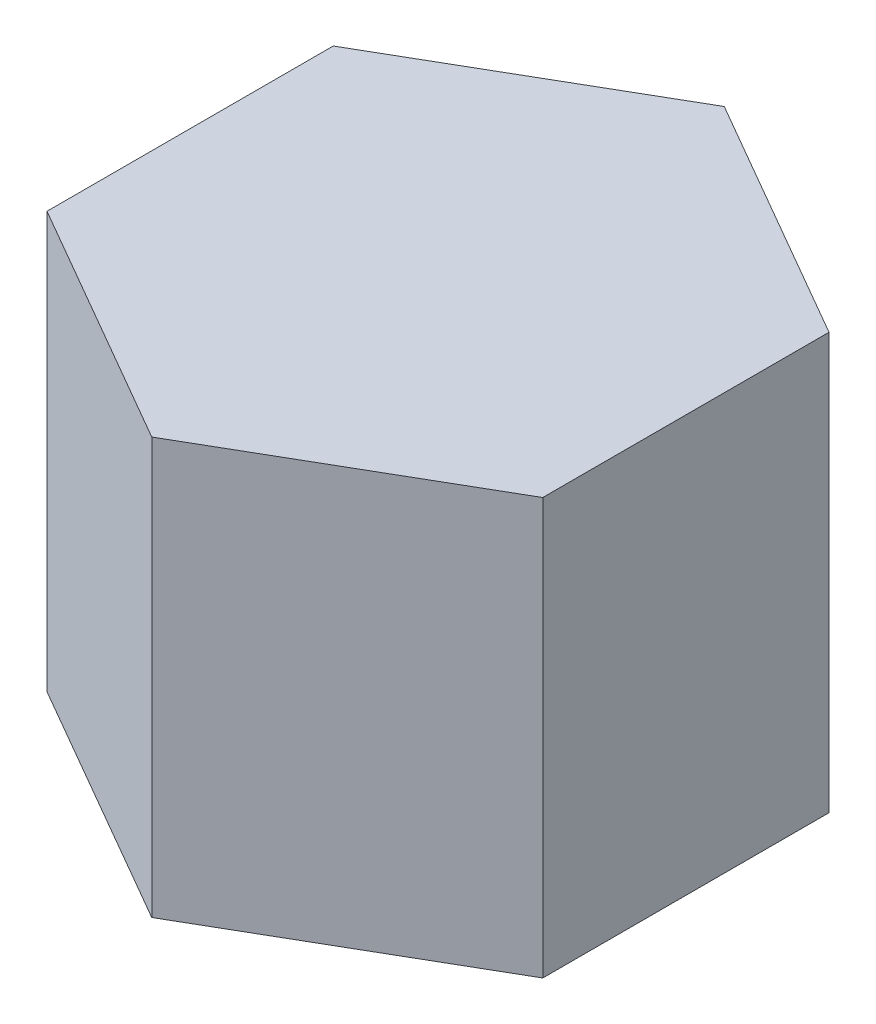
ISO-10303-21;
HEADER;
FILE_DESCRIPTION(('STEP AP214'),'2;1');
FILE_NAME('part.step','',(''),(''),'','','');
FILE_SCHEMA(('AUTOMOTIVE_DESIGN { 1 0 10303 214 1 1 1 1 }'));
ENDSEC;
DATA;
#1=APPLICATION_CONTEXT('core data for automotive mechanical design processes');
#2=APPLICATION_PROTOCOL_DEFINITION('international standard','automotive_design',2000,#1);
#3=PRODUCT_CONTEXT('',#1,'mechanical');
#4=PRODUCT('Part','Part','',(#3));
#5=PRODUCT_RELATED_PRODUCT_CATEGORY('part','',(#4));
#6=PRODUCT_DEFINITION_FORMATION('','',#4);
#7=PRODUCT_DEFINITION_CONTEXT('part definition',#1,'design');
#8=PRODUCT_DEFINITION('design','',#6,#7);
#9=PRODUCT_DEFINITION_SHAPE('','',#8);
#10=(LENGTH_UNIT() NAMED_UNIT(*) SI_UNIT(.MILLI.,.METRE.));
#11=(NAMED_UNIT(*) PLANE_ANGLE_UNIT() SI_UNIT($,.RADIAN.));
#12=(NAMED_UNIT(*) SI_UNIT($,.STERADIAN.) SOLID_ANGLE_UNIT());
#13=UNCERTAINTY_MEASURE_WITH_UNIT(LENGTH_MEASURE(1.E-05),#10,'distance_accuracy_value','');
#14=(GEOMETRIC_REPRESENTATION_CONTEXT(3) GLOBAL_UNCERTAINTY_ASSIGNED_CONTEXT((#13)) GLOBAL_UNIT_ASSIGNED_CONTEXT((#10,
#11,#12)) REPRESENTATION_CONTEXT('',''));
#15=CARTESIAN_POINT('',(0.,0.,0.));
#16=DIRECTION('',(0.,0.,1.));
#17=DIRECTION('',(1.,0.,0.));
#18=AXIS2_PLACEMENT_3D('',#15,#16,#17);
#19=CARTESIAN_POINT('',(204.839551417382,-147.556598747966,287.351844201572));
#20=DIRECTION('',(-0.499999999999943,0.,-0.866025403784471));
#21=DIRECTION('',(-0.866025403784471,0.,0.499999999999943));
#22=AXIS2_PLACEMENT_3D('',#19,#20,#21);
#23=PLANE('',#22);
#24=CARTESIAN_POINT('',(205.142660308706,-147.047793579175,287.176844201572));
#25=DIRECTION('',(-0.866025403784471,0.,0.499999999999943));
#26=VECTOR('',#25,1.);
#27=LINE('',#24,#26);
#28=CARTESIAN_POINT('',(205.142660308706,-147.047793579175,287.176844201572));
#29=VERTEX_POINT('',#28);
#30=CARTESIAN_POINT('',(204.839551417382,-147.047793579175,287.351844201572));
#31=VERTEX_POINT('',#30);
#32=EDGE_CURVE('E170',#29,#31,#27,.T.);
#33=ORIENTED_EDGE('',*,*,#32,.T.);
#34=CARTESIAN_POINT('',(204.839551417382,-147.556598747966,287.351844201572));
#35=DIRECTION('',(0.,1.,0.));
#36=VECTOR('',#35,1.);
#37=LINE('',#34,#36);
#38=CARTESIAN_POINT('',(204.839551417382,-147.556598747966,287.351844201572));
#39=VERTEX_POINT('',#38);
#40=EDGE_CURVE('E35',#39,#31,#37,.T.);
#41=ORIENTED_EDGE('',*,*,#40,.F.);
#42=CARTESIAN_POINT('',(205.142660308706,-147.556598747966,287.176844201572));
#43=DIRECTION('',(-0.866025403784471,0.,0.499999999999943));
#44=VECTOR('',#43,1.);
#45=LINE('',#42,#44);
#46=CARTESIAN_POINT('',(205.142660308706,-147.556598747966,287.176844201572));
#47=VERTEX_POINT('',#46);
#48=EDGE_CURVE('E159',#47,#39,#45,.T.);
#49=ORIENTED_EDGE('',*,*,#48,.F.);
#50=CARTESIAN_POINT('',(205.142660308706,-147.556598747966,287.176844201572));
#51=DIRECTION('',(0.,1.,0.));
#52=VECTOR('',#51,1.);
#53=LINE('',#50,#52);
#54=EDGE_CURVE('E10',#47,#29,#53,.T.);
#55=ORIENTED_EDGE('',*,*,#54,.T.);
#56=EDGE_LOOP('',(#33,#41,#49,#55));
#57=FACE_BOUND('',#56,.T.);
#58=ADVANCED_FACE('F16',(#57),#23,.F.);
#59=CARTESIAN_POINT('',(205.142660308706,-147.556598747966,291.594471220494));
#60=DIRECTION('',(-1.,0.,0.));
#61=DIRECTION('',(0.,-1.,0.));
#62=AXIS2_PLACEMENT_3D('',#59,#60,#61);
#63=PLANE('',#62);
#64=CARTESIAN_POINT('',(205.142660308706,-147.047793579175,286.826844201572));
#65=DIRECTION('',(0.,0.,1.));
#66=VECTOR('',#65,1.);
#67=LINE('',#64,#66);
#68=CARTESIAN_POINT('',(205.142660308706,-147.047793579175,286.826844201572));
#69=VERTEX_POINT('',#68);
#70=EDGE_CURVE('E167',#69,#29,#67,.T.);
#71=ORIENTED_EDGE('',*,*,#70,.T.);
#72=ORIENTED_EDGE('',*,*,#54,.F.);
#73=CARTESIAN_POINT('',(205.142660308706,-147.556598747966,286.826844201572));
#74=DIRECTION('',(0.,0.,1.));
#75=VECTOR('',#74,1.);
#76=LINE('',#73,#75);
#77=CARTESIAN_POINT('',(205.142660308706,-147.556598747966,286.826844201572));
#78=VERTEX_POINT('',#77);
#79=EDGE_CURVE('E156',#78,#47,#76,.T.);
#80=ORIENTED_EDGE('',*,*,#79,.F.);
#81=CARTESIAN_POINT('',(205.142660308706,-147.556598747966,286.826844201572));
#82=DIRECTION('',(0.,1.,0.));
#83=VECTOR('',#82,1.);
#84=LINE('',#81,#83);
#85=EDGE_CURVE('E27',#78,#69,#84,.T.);
#86=ORIENTED_EDGE('',*,*,#85,.T.);
#87=EDGE_LOOP('',(#71,#72,#80,#86));
#88=FACE_BOUND('',#87,.T.);
#89=ADVANCED_FACE('F189',(#88),#63,.F.);
#90=CARTESIAN_POINT('',(205.142660308706,-147.556598747966,286.826844201572));
#91=DIRECTION('',(-0.499999999999943,0.,0.866025403784471));
#92=DIRECTION('',(0.866025403784471,0.,0.499999999999943));
#93=AXIS2_PLACEMENT_3D('',#90,#91,#92);
#94=PLANE('',#93);
#95=CARTESIAN_POINT('',(204.839551417382,-147.047793579175,286.651844201572));
#96=DIRECTION('',(0.866025403784471,0.,0.499999999999943));
#97=VECTOR('',#96,1.);
#98=LINE('',#95,#97);
#99=CARTESIAN_POINT('',(204.839551417382,-147.047793579175,286.651844201572));
#100=VERTEX_POINT('',#99);
#101=EDGE_CURVE('E163',#100,#69,#98,.T.);
#102=ORIENTED_EDGE('',*,*,#101,.T.);
#103=ORIENTED_EDGE('',*,*,#85,.F.);
#104=CARTESIAN_POINT('',(204.839551417382,-147.556598747966,286.651844201572));
#105=DIRECTION('',(0.866025403784471,0.,0.499999999999943));
#106=VECTOR('',#105,1.);
#107=LINE('',#104,#106);
#108=CARTESIAN_POINT('',(204.839551417382,-147.556598747966,286.651844201572));
#109=VERTEX_POINT('',#108);
#110=EDGE_CURVE('E106',#109,#78,#107,.T.);
#111=ORIENTED_EDGE('',*,*,#110,.F.);
#112=CARTESIAN_POINT('',(204.839551417382,-147.556598747966,286.651844201572));
#113=DIRECTION('',(0.,1.,0.));
#114=VECTOR('',#113,1.);
#115=LINE('',#112,#114);
#116=EDGE_CURVE('E94',#109,#100,#115,.T.);
#117=ORIENTED_EDGE('',*,*,#116,.T.);
#118=EDGE_LOOP('',(#102,#103,#111,#117));
#119=FACE_BOUND('',#118,.T.);
#120=ADVANCED_FACE('F198',(#119),#94,.F.);
#121=CARTESIAN_POINT('',(204.839551417382,-147.556598747966,286.651844201572));
#122=DIRECTION('',(0.499999999999978,0.,0.866025403784452));
#123=DIRECTION('',(0.866025403784452,0.,-0.499999999999978));
#124=AXIS2_PLACEMENT_3D('',#121,#122,#123);
#125=PLANE('',#124);
#126=CARTESIAN_POINT('',(204.536442526057,-147.047793579175,286.826844201572));
#127=DIRECTION('',(0.866025403784452,0.,-0.499999999999978));
#128=VECTOR('',#127,1.);
#129=LINE('',#126,#128);
#130=CARTESIAN_POINT('',(204.536442526057,-147.047793579175,286.826844201572));
#131=VERTEX_POINT('',#130);
#132=EDGE_CURVE('E162',#131,#100,#129,.T.);
#133=ORIENTED_EDGE('',*,*,#132,.T.);
#134=ORIENTED_EDGE('',*,*,#116,.F.);
#135=CARTESIAN_POINT('',(204.536442526057,-147.556598747966,286.826844201572));
#136=DIRECTION('',(0.866025403784452,0.,-0.499999999999978));
#137=VECTOR('',#136,1.);
#138=LINE('',#135,#137);
#139=CARTESIAN_POINT('',(204.536442526057,-147.556598747966,286.826844201572));
#140=VERTEX_POINT('',#139);
#141=EDGE_CURVE('E98',#140,#109,#138,.T.);
#142=ORIENTED_EDGE('',*,*,#141,.F.);
#143=CARTESIAN_POINT('',(204.536442526057,-147.556598747966,286.826844201572));
#144=DIRECTION('',(0.,1.,0.));
#145=VECTOR('',#144,1.);
#146=LINE('',#143,#145);
#147=EDGE_CURVE('E79',#140,#131,#146,.T.);
#148=ORIENTED_EDGE('',*,*,#147,.T.);
#149=EDGE_LOOP('',(#133,#134,#142,#148));
#150=FACE_BOUND('',#149,.T.);
#151=ADVANCED_FACE('F100',(#150),#125,.F.);
#152=CARTESIAN_POINT('',(204.536442526057,-147.556598747966,291.594471220494));
#153=DIRECTION('',(1.,0.,0.));
#154=DIRECTION('',(0.,1.,0.));
#155=AXIS2_PLACEMENT_3D('',#152,#153,#154);
#156=PLANE('',#155);
#157=CARTESIAN_POINT('',(204.536442526057,-147.047793579175,287.176844201572));
#158=DIRECTION('',(0.,0.,-1.));
#159=VECTOR('',#158,1.);
#160=LINE('',#157,#159);
#161=CARTESIAN_POINT('',(204.536442526057,-147.047793579175,287.176844201572));
#162=VERTEX_POINT('',#161);
#163=EDGE_CURVE('E88',#162,#131,#160,.T.);
#164=ORIENTED_EDGE('',*,*,#163,.T.);
#165=ORIENTED_EDGE('',*,*,#147,.F.);
#166=CARTESIAN_POINT('',(204.536442526057,-147.556598747966,287.176844201572));
#167=DIRECTION('',(0.,0.,-1.));
#168=VECTOR('',#167,1.);
#169=LINE('',#166,#168);
#170=CARTESIAN_POINT('',(204.536442526057,-147.556598747966,287.176844201572));
#171=VERTEX_POINT('',#170);
#172=EDGE_CURVE('E84',#171,#140,#169,.T.);
#173=ORIENTED_EDGE('',*,*,#172,.F.);
#174=CARTESIAN_POINT('',(204.536442526057,-147.556598747966,287.176844201572));
#175=DIRECTION('',(0.,1.,0.));
#176=VECTOR('',#175,1.);
#177=LINE('',#174,#176);
#178=EDGE_CURVE('E58',#171,#162,#177,.T.);
#179=ORIENTED_EDGE('',*,*,#178,.T.);
#180=EDGE_LOOP('',(#164,#165,#173,#179));
#181=FACE_BOUND('',#180,.T.);
#182=ADVANCED_FACE('F82',(#181),#156,.F.);
#183=CARTESIAN_POINT('',(204.536442526057,-147.556598747966,287.176844201572));
#184=DIRECTION('',(0.500000000000062,0.,-0.866025403784403));
#185=DIRECTION('',(-0.866025403784403,0.,-0.500000000000062));
#186=AXIS2_PLACEMENT_3D('',#183,#184,#185);
#187=PLANE('',#186);
#188=CARTESIAN_POINT('',(204.839551417382,-147.047793579175,287.351844201572));
#189=DIRECTION('',(-0.866025403784403,0.,-0.500000000000062));
#190=VECTOR('',#189,1.);
#191=LINE('',#188,#190);
#192=EDGE_CURVE('E160',#31,#162,#191,.T.);
#193=ORIENTED_EDGE('',*,*,#192,.T.);
#194=ORIENTED_EDGE('',*,*,#178,.F.);
#195=CARTESIAN_POINT('',(204.839551417382,-147.556598747966,287.351844201572));
#196=DIRECTION('',(-0.866025403784403,0.,-0.500000000000062));
#197=VECTOR('',#196,1.);
#198=LINE('',#195,#197);
#199=EDGE_CURVE('E112',#39,#171,#198,.T.);
#200=ORIENTED_EDGE('',*,*,#199,.F.);
#201=ORIENTED_EDGE('',*,*,#40,.T.);
#202=EDGE_LOOP('',(#193,#194,#200,#201));
#203=FACE_BOUND('',#202,.T.);
#204=ADVANCED_FACE('F131',(#203),#187,.F.);
#205=CARTESIAN_POINT('',(206.491105863044,-147.556598747966,291.594471220494));
#206=DIRECTION('',(0.,1.,0.));
#207=DIRECTION('',(-1.,0.,0.));
#208=AXIS2_PLACEMENT_3D('',#205,#206,#207);
#209=PLANE('',#208);
#210=ORIENTED_EDGE('',*,*,#48,.T.);
#211=ORIENTED_EDGE('',*,*,#199,.T.);
#212=ORIENTED_EDGE('',*,*,#172,.T.);
#213=ORIENTED_EDGE('',*,*,#141,.T.);
#214=ORIENTED_EDGE('',*,*,#110,.T.);
#215=ORIENTED_EDGE('',*,*,#79,.T.);
#216=EDGE_LOOP('',(#210,#211,#212,#213,#214,#215));
#217=FACE_BOUND('',#216,.T.);
#218=ADVANCED_FACE('F111',(#217),#209,.F.);
#219=CARTESIAN_POINT('',(206.491105863044,-147.047793579175,291.594471220494));
#220=DIRECTION('',(0.,1.,0.));
#221=DIRECTION('',(-1.,0.,0.));
#222=AXIS2_PLACEMENT_3D('',#219,#220,#221);
#223=PLANE('',#222);
#224=ORIENTED_EDGE('',*,*,#32,.F.);
#225=ORIENTED_EDGE('',*,*,#70,.F.);
#226=ORIENTED_EDGE('',*,*,#101,.F.);
#227=ORIENTED_EDGE('',*,*,#132,.F.);
#228=ORIENTED_EDGE('',*,*,#163,.F.);
#229=ORIENTED_EDGE('',*,*,#192,.F.);
#230=EDGE_LOOP('',(#224,#225,#226,#227,#228,#229));
#231=FACE_BOUND('',#230,.T.);
#232=ADVANCED_FACE('F130',(#231),#223,.T.);
#233=CLOSED_SHELL('',(#58,#89,#120,#151,#182,#204,#218,#232));
#234=MANIFOLD_SOLID_BREP('B1',#233);
#235=ADVANCED_BREP_SHAPE_REPRESENTATION('',(#18,#234),#14);
#236=SHAPE_DEFINITION_REPRESENTATION(#9,#235);
ENDSEC;
END-ISO-10303-21;
